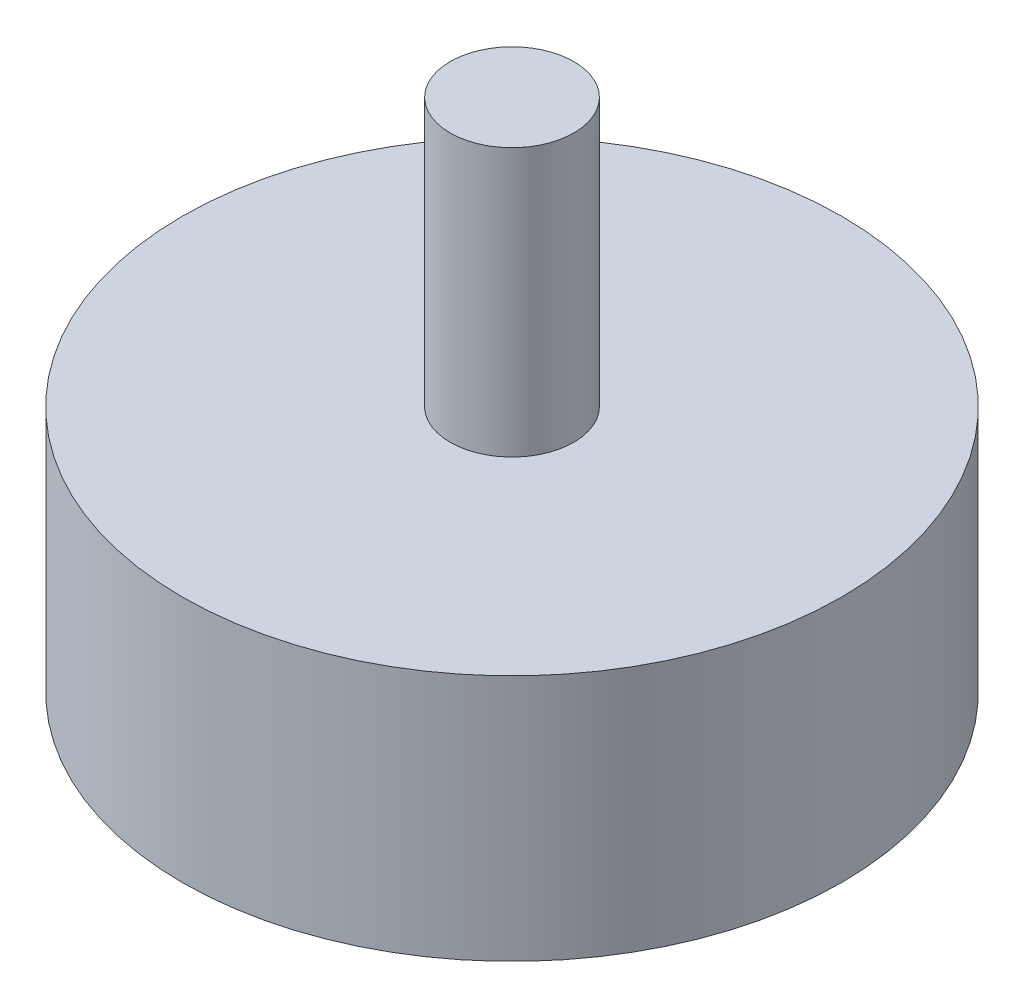
ISO-10303-21;
HEADER;
FILE_DESCRIPTION(('STEP AP214'),'2;1');
FILE_NAME('part.step','',(''),(''),'','','');
FILE_SCHEMA(('AUTOMOTIVE_DESIGN { 1 0 10303 214 1 1 1 1 }'));
ENDSEC;
DATA;
#1=APPLICATION_CONTEXT('core data for automotive mechanical design processes');
#2=APPLICATION_PROTOCOL_DEFINITION('international standard','automotive_design',2000,#1);
#3=PRODUCT_CONTEXT('',#1,'mechanical');
#4=PRODUCT('Part','Part','',(#3));
#5=PRODUCT_RELATED_PRODUCT_CATEGORY('part','',(#4));
#6=PRODUCT_DEFINITION_FORMATION('','',#4);
#7=PRODUCT_DEFINITION_CONTEXT('part definition',#1,'design');
#8=PRODUCT_DEFINITION('design','',#6,#7);
#9=PRODUCT_DEFINITION_SHAPE('','',#8);
#10=(LENGTH_UNIT() NAMED_UNIT(*) SI_UNIT(.MILLI.,.METRE.));
#11=(NAMED_UNIT(*) PLANE_ANGLE_UNIT() SI_UNIT($,.RADIAN.));
#12=(NAMED_UNIT(*) SI_UNIT($,.STERADIAN.) SOLID_ANGLE_UNIT());
#13=UNCERTAINTY_MEASURE_WITH_UNIT(LENGTH_MEASURE(1.E-05),#10,'distance_accuracy_value','');
#14=(GEOMETRIC_REPRESENTATION_CONTEXT(3) GLOBAL_UNCERTAINTY_ASSIGNED_CONTEXT((#13)) GLOBAL_UNIT_ASSIGNED_CONTEXT((#10,
#11,#12)) REPRESENTATION_CONTEXT('',''));
#15=CARTESIAN_POINT('',(0.,0.,0.));
#16=DIRECTION('',(0.,0.,1.));
#17=DIRECTION('',(1.,0.,0.));
#18=AXIS2_PLACEMENT_3D('',#15,#16,#17);
#19=CARTESIAN_POINT('',(0.,-30.1625,0.));
#20=DIRECTION('',(0.,1.,0.));
#21=DIRECTION('',(0.,0.,1.));
#22=AXIS2_PLACEMENT_3D('',#19,#20,#21);
#23=CYLINDRICAL_SURFACE('',#22,4.7625);
#24=CARTESIAN_POINT('',(0.,-9.525,0.));
#25=DIRECTION('',(0.,1.,0.));
#26=DIRECTION('',(0.,0.,1.));
#27=AXIS2_PLACEMENT_3D('',#24,#25,#26);
#28=CIRCLE('',#27,4.7625);
#29=CARTESIAN_POINT('',(0.,-9.525,4.7625));
#30=VERTEX_POINT('',#29);
#31=EDGE_CURVE('E48',#30,#30,#28,.T.);
#32=ORIENTED_EDGE('',*,*,#31,.F.);
#33=EDGE_LOOP('',(#32));
#34=FACE_BOUND('',#33,.T.);
#35=CARTESIAN_POINT('',(0.,-22.225,0.));
#36=DIRECTION('',(0.,-1.,0.));
#37=DIRECTION('',(0.,0.,-1.));
#38=AXIS2_PLACEMENT_3D('',#35,#36,#37);
#39=CIRCLE('',#38,4.7625);
#40=CARTESIAN_POINT('',(0.,-22.225,-4.7625));
#41=VERTEX_POINT('',#40);
#42=EDGE_CURVE('E53',#41,#41,#39,.T.);
#43=ORIENTED_EDGE('',*,*,#42,.F.);
#44=EDGE_LOOP('',(#43));
#45=FACE_BOUND('',#44,.T.);
#46=ADVANCED_FACE('F32',(#34,#45),#23,.T.);
#47=CARTESIAN_POINT('',(0.,9.525,0.));
#48=DIRECTION('',(0.,1.,0.));
#49=DIRECTION('',(0.,0.,1.));
#50=AXIS2_PLACEMENT_3D('',#47,#48,#49);
#51=PLANE('',#50);
#52=CARTESIAN_POINT('',(0.,9.525,0.));
#53=DIRECTION('',(0.,1.,0.));
#54=DIRECTION('',(0.,0.,1.));
#55=AXIS2_PLACEMENT_3D('',#52,#53,#54);
#56=CIRCLE('',#55,25.4);
#57=CARTESIAN_POINT('',(0.,9.525,25.4));
#58=VERTEX_POINT('',#57);
#59=EDGE_CURVE('E10',#58,#58,#56,.T.);
#60=ORIENTED_EDGE('',*,*,#59,.T.);
#61=EDGE_LOOP('',(#60));
#62=FACE_BOUND('',#61,.T.);
#63=CARTESIAN_POINT('',(0.,9.525,0.));
#64=DIRECTION('',(0.,1.,0.));
#65=DIRECTION('',(0.,0.,1.));
#66=AXIS2_PLACEMENT_3D('',#63,#64,#65);
#67=CIRCLE('',#66,4.7625);
#68=CARTESIAN_POINT('',(0.,9.525,4.7625));
#69=VERTEX_POINT('',#68);
#70=EDGE_CURVE('E45',#69,#69,#67,.T.);
#71=ORIENTED_EDGE('',*,*,#70,.F.);
#72=EDGE_LOOP('',(#71));
#73=FACE_BOUND('',#72,.T.);
#74=ADVANCED_FACE('F60',(#62,#73),#51,.T.);
#75=CARTESIAN_POINT('',(0.,9.525,0.));
#76=DIRECTION('',(0.,-1.,0.));
#77=DIRECTION('',(0.,0.,-1.));
#78=AXIS2_PLACEMENT_3D('',#75,#76,#77);
#79=CYLINDRICAL_SURFACE('',#78,25.4);
#80=ORIENTED_EDGE('',*,*,#59,.F.);
#81=EDGE_LOOP('',(#80));
#82=FACE_BOUND('',#81,.T.);
#83=CARTESIAN_POINT('',(0.,-9.525,0.));
#84=DIRECTION('',(0.,1.,0.));
#85=DIRECTION('',(0.,0.,1.));
#86=AXIS2_PLACEMENT_3D('',#83,#84,#85);
#87=CIRCLE('',#86,25.4);
#88=CARTESIAN_POINT('',(0.,-9.525,25.4));
#89=VERTEX_POINT('',#88);
#90=EDGE_CURVE('E36',#89,#89,#87,.T.);
#91=ORIENTED_EDGE('',*,*,#90,.T.);
#92=EDGE_LOOP('',(#91));
#93=FACE_BOUND('',#92,.T.);
#94=ADVANCED_FACE('F34',(#82,#93),#79,.T.);
#95=CARTESIAN_POINT('',(0.,-9.525,0.));
#96=DIRECTION('',(0.,1.,0.));
#97=DIRECTION('',(0.,0.,1.));
#98=AXIS2_PLACEMENT_3D('',#95,#96,#97);
#99=PLANE('',#98);
#100=ORIENTED_EDGE('',*,*,#31,.T.);
#101=EDGE_LOOP('',(#100));
#102=FACE_BOUND('',#101,.T.);
#103=ORIENTED_EDGE('',*,*,#90,.F.);
#104=EDGE_LOOP('',(#103));
#105=FACE_BOUND('',#104,.T.);
#106=ADVANCED_FACE('F76',(#102,#105),#99,.F.);
#107=CARTESIAN_POINT('',(0.,30.1625,0.));
#108=DIRECTION('',(0.,-1.,0.));
#109=DIRECTION('',(0.,0.,-1.));
#110=AXIS2_PLACEMENT_3D('',#107,#108,#109);
#111=CYLINDRICAL_SURFACE('',#110,4.7625);
#112=CARTESIAN_POINT('',(0.,30.1625,0.));
#113=DIRECTION('',(0.,1.,0.));
#114=DIRECTION('',(0.,0.,1.));
#115=AXIS2_PLACEMENT_3D('',#112,#113,#114);
#116=CIRCLE('',#115,4.7625);
#117=CARTESIAN_POINT('',(0.,30.1625,4.7625));
#118=VERTEX_POINT('',#117);
#119=EDGE_CURVE('E43',#118,#118,#116,.T.);
#120=ORIENTED_EDGE('',*,*,#119,.F.);
#121=EDGE_LOOP('',(#120));
#122=FACE_BOUND('',#121,.T.);
#123=ORIENTED_EDGE('',*,*,#70,.T.);
#124=EDGE_LOOP('',(#123));
#125=FACE_BOUND('',#124,.T.);
#126=ADVANCED_FACE('F73',(#122,#125),#111,.T.);
#127=CARTESIAN_POINT('',(0.,30.1625,0.));
#128=DIRECTION('',(0.,1.,0.));
#129=DIRECTION('',(0.,0.,1.));
#130=AXIS2_PLACEMENT_3D('',#127,#128,#129);
#131=PLANE('',#130);
#132=ORIENTED_EDGE('',*,*,#119,.T.);
#133=EDGE_LOOP('',(#132));
#134=FACE_BOUND('',#133,.T.);
#135=ADVANCED_FACE('F70',(#134),#131,.T.);
#136=CARTESIAN_POINT('',(0.,-22.225,0.));
#137=DIRECTION('',(0.,-1.,0.));
#138=DIRECTION('',(0.,0.,-1.));
#139=AXIS2_PLACEMENT_3D('',#136,#137,#138);
#140=PLANE('',#139);
#141=ORIENTED_EDGE('',*,*,#42,.T.);
#142=EDGE_LOOP('',(#141));
#143=FACE_BOUND('',#142,.T.);
#144=ADVANCED_FACE('F57',(#143),#140,.T.);
#145=CLOSED_SHELL('',(#46,#74,#94,#106,#126,#135,#144));
#146=MANIFOLD_SOLID_BREP('B2',#145);
#147=ADVANCED_BREP_SHAPE_REPRESENTATION('',(#18,#146),#14);
#148=SHAPE_DEFINITION_REPRESENTATION(#9,#147);
ENDSEC;
END-ISO-10303-21;
